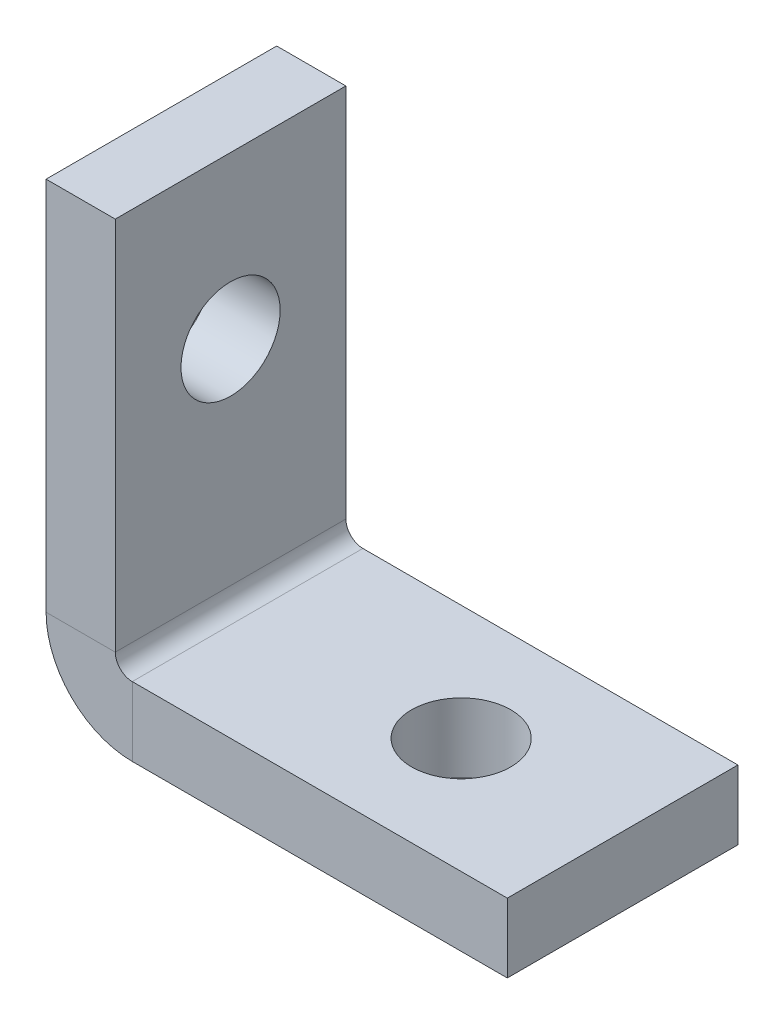
ISO-10303-21;
HEADER;
FILE_DESCRIPTION(('STEP AP214'),'2;1');
FILE_NAME('part.step','',(''),(''),'','','');
FILE_SCHEMA(('AUTOMOTIVE_DESIGN { 1 0 10303 214 1 1 1 1 }'));
ENDSEC;
DATA;
#1=APPLICATION_CONTEXT('core data for automotive mechanical design processes');
#2=APPLICATION_PROTOCOL_DEFINITION('international standard','automotive_design',2000,#1);
#3=PRODUCT_CONTEXT('',#1,'mechanical');
#4=PRODUCT('Part','Part','',(#3));
#5=PRODUCT_RELATED_PRODUCT_CATEGORY('part','',(#4));
#6=PRODUCT_DEFINITION_FORMATION('','',#4);
#7=PRODUCT_DEFINITION_CONTEXT('part definition',#1,'design');
#8=PRODUCT_DEFINITION('design','',#6,#7);
#9=PRODUCT_DEFINITION_SHAPE('','',#8);
#10=(LENGTH_UNIT() NAMED_UNIT(*) SI_UNIT(.MILLI.,.METRE.));
#11=(NAMED_UNIT(*) PLANE_ANGLE_UNIT() SI_UNIT($,.RADIAN.));
#12=(NAMED_UNIT(*) SI_UNIT($,.STERADIAN.) SOLID_ANGLE_UNIT());
#13=UNCERTAINTY_MEASURE_WITH_UNIT(LENGTH_MEASURE(1.E-05),#10,'distance_accuracy_value','');
#14=(GEOMETRIC_REPRESENTATION_CONTEXT(3) GLOBAL_UNCERTAINTY_ASSIGNED_CONTEXT((#13)) GLOBAL_UNIT_ASSIGNED_CONTEXT((#10,
#11,#12)) REPRESENTATION_CONTEXT('',''));
#15=CARTESIAN_POINT('',(0.,0.,0.));
#16=DIRECTION('',(0.,0.,1.));
#17=DIRECTION('',(1.,0.,0.));
#18=AXIS2_PLACEMENT_3D('',#15,#16,#17);
#19=CARTESIAN_POINT('',(0.,3.7366,10.));
#20=DIRECTION('',(0.,0.,1.));
#21=DIRECTION('',(1.,0.,0.));
#22=AXIS2_PLACEMENT_3D('',#19,#20,#21);
#23=PLANE('',#22);
#24=DIRECTION('',(1.,0.,0.));
#25=VECTOR('',#24,1.);
#26=CARTESIAN_POINT('',(0.,3.7366,10.));
#27=LINE('',#26,#25);
#28=CARTESIAN_POINT('',(0.,3.7366,10.));
#29=VERTEX_POINT('',#28);
#30=CARTESIAN_POINT('',(3.,3.7366,10.));
#31=VERTEX_POINT('',#30);
#32=EDGE_CURVE('E11',#29,#31,#27,.T.);
#33=ORIENTED_EDGE('',*,*,#32,.F.);
#34=CARTESIAN_POINT('',(3.7366,3.7366,10.));
#35=DIRECTION('',(0.,0.,-1.));
#36=DIRECTION('',(-1.,0.,0.));
#37=AXIS2_PLACEMENT_3D('',#34,#35,#36);
#38=CIRCLE('',#37,3.7366);
#39=CARTESIAN_POINT('',(3.7366,0.,10.));
#40=VERTEX_POINT('',#39);
#41=EDGE_CURVE('E135',#29,#40,#38,.F.);
#42=ORIENTED_EDGE('',*,*,#41,.T.);
#43=DIRECTION('',(0.,-1.,0.));
#44=VECTOR('',#43,1.);
#45=CARTESIAN_POINT('',(3.7366,3.,10.));
#46=LINE('',#45,#44);
#47=CARTESIAN_POINT('',(3.7366,3.,10.));
#48=VERTEX_POINT('',#47);
#49=EDGE_CURVE('E53',#48,#40,#46,.T.);
#50=ORIENTED_EDGE('',*,*,#49,.F.);
#51=CARTESIAN_POINT('',(3.7366,3.7366,10.));
#52=DIRECTION('',(0.,0.,1.));
#53=DIRECTION('',(1.,0.,0.));
#54=AXIS2_PLACEMENT_3D('',#51,#52,#53);
#55=CIRCLE('',#54,0.7366);
#56=EDGE_CURVE('E142',#31,#48,#55,.T.);
#57=ORIENTED_EDGE('',*,*,#56,.F.);
#58=EDGE_LOOP('',(#33,#42,#50,#57));
#59=FACE_BOUND('',#58,.T.);
#60=ADVANCED_FACE('F45',(#59),#23,.T.);
#61=CARTESIAN_POINT('',(3.7366,3.,10.));
#62=DIRECTION('',(0.,0.,1.));
#63=DIRECTION('',(1.,0.,0.));
#64=AXIS2_PLACEMENT_3D('',#61,#62,#63);
#65=PLANE('',#64);
#66=DIRECTION('',(0.,-1.,0.));
#67=VECTOR('',#66,1.);
#68=CARTESIAN_POINT('',(0.,20.,10.));
#69=LINE('',#68,#67);
#70=CARTESIAN_POINT('',(0.,20.,10.));
#71=VERTEX_POINT('',#70);
#72=EDGE_CURVE('E130',#71,#29,#69,.T.);
#73=ORIENTED_EDGE('',*,*,#72,.T.);
#74=ORIENTED_EDGE('',*,*,#32,.T.);
#75=DIRECTION('',(0.,1.,0.));
#76=VECTOR('',#75,1.);
#77=CARTESIAN_POINT('',(3.,20.,10.));
#78=LINE('',#77,#76);
#79=CARTESIAN_POINT('',(3.,20.,10.));
#80=VERTEX_POINT('',#79);
#81=EDGE_CURVE('E140',#80,#31,#78,.F.);
#82=ORIENTED_EDGE('',*,*,#81,.F.);
#83=DIRECTION('',(1.,0.,0.));
#84=VECTOR('',#83,1.);
#85=CARTESIAN_POINT('',(0.,20.,10.));
#86=LINE('',#85,#84);
#87=EDGE_CURVE('E121',#71,#80,#86,.T.);
#88=ORIENTED_EDGE('',*,*,#87,.F.);
#89=EDGE_LOOP('',(#73,#74,#82,#88));
#90=FACE_BOUND('',#89,.T.);
#91=ADVANCED_FACE('F138',(#90),#65,.T.);
#92=CARTESIAN_POINT('',(3.7366,0.,0.));
#93=DIRECTION('',(0.,0.,-1.));
#94=DIRECTION('',(-1.,0.,0.));
#95=AXIS2_PLACEMENT_3D('',#92,#93,#94);
#96=PLANE('',#95);
#97=DIRECTION('',(0.,1.,0.));
#98=VECTOR('',#97,1.);
#99=CARTESIAN_POINT('',(3.7366,0.,0.));
#100=LINE('',#99,#98);
#101=CARTESIAN_POINT('',(3.7366,0.,0.));
#102=VERTEX_POINT('',#101);
#103=CARTESIAN_POINT('',(3.7366,3.,0.));
#104=VERTEX_POINT('',#103);
#105=EDGE_CURVE('E96',#102,#104,#100,.T.);
#106=ORIENTED_EDGE('',*,*,#105,.F.);
#107=CARTESIAN_POINT('',(3.7366,3.7366,0.));
#108=DIRECTION('',(0.,0.,-1.));
#109=DIRECTION('',(-1.,0.,0.));
#110=AXIS2_PLACEMENT_3D('',#107,#108,#109);
#111=CIRCLE('',#110,3.7366);
#112=CARTESIAN_POINT('',(0.,3.7366,0.));
#113=VERTEX_POINT('',#112);
#114=EDGE_CURVE('E165',#113,#102,#111,.F.);
#115=ORIENTED_EDGE('',*,*,#114,.F.);
#116=DIRECTION('',(-1.,0.,0.));
#117=VECTOR('',#116,1.);
#118=CARTESIAN_POINT('',(3.,3.7366,0.));
#119=LINE('',#118,#117);
#120=CARTESIAN_POINT('',(3.,3.7366,0.));
#121=VERTEX_POINT('',#120);
#122=EDGE_CURVE('E89',#121,#113,#119,.T.);
#123=ORIENTED_EDGE('',*,*,#122,.F.);
#124=CARTESIAN_POINT('',(3.7366,3.7366,0.));
#125=DIRECTION('',(0.,0.,1.));
#126=DIRECTION('',(1.,0.,0.));
#127=AXIS2_PLACEMENT_3D('',#124,#125,#126);
#128=CIRCLE('',#127,0.7366);
#129=EDGE_CURVE('E158',#121,#104,#128,.T.);
#130=ORIENTED_EDGE('',*,*,#129,.T.);
#131=EDGE_LOOP('',(#106,#115,#123,#130));
#132=FACE_BOUND('',#131,.T.);
#133=ADVANCED_FACE('F197',(#132),#96,.T.);
#134=CARTESIAN_POINT('',(3.,3.7366,0.));
#135=DIRECTION('',(0.,0.,-1.));
#136=DIRECTION('',(-1.,0.,0.));
#137=AXIS2_PLACEMENT_3D('',#134,#135,#136);
#138=PLANE('',#137);
#139=DIRECTION('',(1.,0.,0.));
#140=VECTOR('',#139,1.);
#141=CARTESIAN_POINT('',(0.,0.,0.));
#142=LINE('',#141,#140);
#143=CARTESIAN_POINT('',(20.,0.,0.));
#144=VERTEX_POINT('',#143);
#145=EDGE_CURVE('E148',#102,#144,#142,.T.);
#146=ORIENTED_EDGE('',*,*,#145,.F.);
#147=ORIENTED_EDGE('',*,*,#105,.T.);
#148=DIRECTION('',(1.,0.,0.));
#149=VECTOR('',#148,1.);
#150=CARTESIAN_POINT('',(0.,3.,0.));
#151=LINE('',#150,#149);
#152=CARTESIAN_POINT('',(20.,3.,0.));
#153=VERTEX_POINT('',#152);
#154=EDGE_CURVE('E155',#104,#153,#151,.T.);
#155=ORIENTED_EDGE('',*,*,#154,.T.);
#156=DIRECTION('',(0.,-1.,0.));
#157=VECTOR('',#156,1.);
#158=CARTESIAN_POINT('',(20.,3.,0.));
#159=LINE('',#158,#157);
#160=EDGE_CURVE('E151',#153,#144,#159,.T.);
#161=ORIENTED_EDGE('',*,*,#160,.T.);
#162=EDGE_LOOP('',(#146,#147,#155,#161));
#163=FACE_BOUND('',#162,.T.);
#164=ADVANCED_FACE('F184',(#163),#138,.T.);
#165=CARTESIAN_POINT('',(0.,0.,10.));
#166=DIRECTION('',(0.,1.,0.));
#167=DIRECTION('',(0.,0.,1.));
#168=AXIS2_PLACEMENT_3D('',#165,#166,#167);
#169=PLANE('',#168);
#170=CARTESIAN_POINT('',(13.,0.,5.));
#171=DIRECTION('',(0.,-1.,0.));
#172=DIRECTION('',(0.,0.,-1.));
#173=AXIS2_PLACEMENT_3D('',#170,#171,#172);
#174=CIRCLE('',#173,2.14999999999999);
#175=CARTESIAN_POINT('',(13.,0.,2.85000000000001));
#176=VERTEX_POINT('',#175);
#177=EDGE_CURVE('E217',#176,#176,#174,.T.);
#178=ORIENTED_EDGE('',*,*,#177,.F.);
#179=EDGE_LOOP('',(#178));
#180=FACE_BOUND('',#179,.T.);
#181=ORIENTED_EDGE('',*,*,#145,.T.);
#182=DIRECTION('',(0.,0.,-1.));
#183=VECTOR('',#182,1.);
#184=CARTESIAN_POINT('',(20.,0.,10.));
#185=LINE('',#184,#183);
#186=CARTESIAN_POINT('',(20.,0.,10.));
#187=VERTEX_POINT('',#186);
#188=EDGE_CURVE('E179',#187,#144,#185,.T.);
#189=ORIENTED_EDGE('',*,*,#188,.F.);
#190=DIRECTION('',(1.,0.,0.));
#191=VECTOR('',#190,1.);
#192=CARTESIAN_POINT('',(0.,0.,10.));
#193=LINE('',#192,#191);
#194=EDGE_CURVE('E102',#40,#187,#193,.T.);
#195=ORIENTED_EDGE('',*,*,#194,.F.);
#196=DIRECTION('',(0.,0.,-1.));
#197=VECTOR('',#196,1.);
#198=CARTESIAN_POINT('',(3.7366,0.,10.));
#199=LINE('',#198,#197);
#200=EDGE_CURVE('E147',#40,#102,#199,.T.);
#201=ORIENTED_EDGE('',*,*,#200,.T.);
#202=EDGE_LOOP('',(#181,#189,#195,#201));
#203=FACE_BOUND('',#202,.T.);
#204=ADVANCED_FACE('F224',(#180,#203),#169,.F.);
#205=CARTESIAN_POINT('',(20.,3.,10.));
#206=DIRECTION('',(1.,0.,0.));
#207=DIRECTION('',(0.,0.,-1.));
#208=AXIS2_PLACEMENT_3D('',#205,#206,#207);
#209=PLANE('',#208);
#210=ORIENTED_EDGE('',*,*,#160,.F.);
#211=DIRECTION('',(0.,0.,-1.));
#212=VECTOR('',#211,1.);
#213=CARTESIAN_POINT('',(20.,3.,10.));
#214=LINE('',#213,#212);
#215=CARTESIAN_POINT('',(20.,3.,10.));
#216=VERTEX_POINT('',#215);
#217=EDGE_CURVE('E177',#216,#153,#214,.T.);
#218=ORIENTED_EDGE('',*,*,#217,.F.);
#219=DIRECTION('',(0.,-1.,0.));
#220=VECTOR('',#219,1.);
#221=CARTESIAN_POINT('',(20.,3.,10.));
#222=LINE('',#221,#220);
#223=EDGE_CURVE('E203',#216,#187,#222,.T.);
#224=ORIENTED_EDGE('',*,*,#223,.T.);
#225=ORIENTED_EDGE('',*,*,#188,.T.);
#226=EDGE_LOOP('',(#210,#218,#224,#225));
#227=FACE_BOUND('',#226,.T.);
#228=ADVANCED_FACE('F227',(#227),#209,.T.);
#229=CARTESIAN_POINT('',(0.,3.,10.));
#230=DIRECTION('',(0.,1.,0.));
#231=DIRECTION('',(0.,0.,1.));
#232=AXIS2_PLACEMENT_3D('',#229,#230,#231);
#233=PLANE('',#232);
#234=CARTESIAN_POINT('',(13.,3.,5.));
#235=DIRECTION('',(0.,1.,0.));
#236=DIRECTION('',(0.,0.,1.));
#237=AXIS2_PLACEMENT_3D('',#234,#235,#236);
#238=CIRCLE('',#237,2.14999999999999);
#239=CARTESIAN_POINT('',(13.,3.,7.15));
#240=VERTEX_POINT('',#239);
#241=EDGE_CURVE('E214',#240,#240,#238,.T.);
#242=ORIENTED_EDGE('',*,*,#241,.F.);
#243=EDGE_LOOP('',(#242));
#244=FACE_BOUND('',#243,.T.);
#245=ORIENTED_EDGE('',*,*,#154,.F.);
#246=DIRECTION('',(0.,0.,-1.));
#247=VECTOR('',#246,1.);
#248=CARTESIAN_POINT('',(3.7366,3.,10.));
#249=LINE('',#248,#247);
#250=EDGE_CURVE('E174',#48,#104,#249,.T.);
#251=ORIENTED_EDGE('',*,*,#250,.F.);
#252=DIRECTION('',(1.,0.,0.));
#253=VECTOR('',#252,1.);
#254=CARTESIAN_POINT('',(0.,3.,10.));
#255=LINE('',#254,#253);
#256=EDGE_CURVE('E202',#48,#216,#255,.T.);
#257=ORIENTED_EDGE('',*,*,#256,.T.);
#258=ORIENTED_EDGE('',*,*,#217,.T.);
#259=EDGE_LOOP('',(#245,#251,#257,#258));
#260=FACE_BOUND('',#259,.T.);
#261=ADVANCED_FACE('F195',(#244,#260),#233,.T.);
#262=CARTESIAN_POINT('',(3.7366,3.7366,10.));
#263=DIRECTION('',(0.,0.,-1.));
#264=DIRECTION('',(-1.,0.,0.));
#265=AXIS2_PLACEMENT_3D('',#262,#263,#264);
#266=CYLINDRICAL_SURFACE('',#265,0.7366);
#267=ORIENTED_EDGE('',*,*,#129,.F.);
#268=DIRECTION('',(0.,0.,-1.));
#269=VECTOR('',#268,1.);
#270=CARTESIAN_POINT('',(3.,3.7366,10.));
#271=LINE('',#270,#269);
#272=EDGE_CURVE('E171',#31,#121,#271,.T.);
#273=ORIENTED_EDGE('',*,*,#272,.F.);
#274=ORIENTED_EDGE('',*,*,#56,.T.);
#275=ORIENTED_EDGE('',*,*,#250,.T.);
#276=EDGE_LOOP('',(#267,#273,#274,#275));
#277=FACE_BOUND('',#276,.T.);
#278=ADVANCED_FACE('F190',(#277),#266,.F.);
#279=CARTESIAN_POINT('',(3.,20.,10.));
#280=DIRECTION('',(1.,0.,0.));
#281=DIRECTION('',(0.,0.,-1.));
#282=AXIS2_PLACEMENT_3D('',#279,#280,#281);
#283=PLANE('',#282);
#284=CARTESIAN_POINT('',(3.,13.,5.));
#285=DIRECTION('',(1.,0.,0.));
#286=DIRECTION('',(0.,0.,-1.));
#287=AXIS2_PLACEMENT_3D('',#284,#285,#286);
#288=CIRCLE('',#287,2.14999999999999);
#289=CARTESIAN_POINT('',(3.,13.,2.85000000000001));
#290=VERTEX_POINT('',#289);
#291=EDGE_CURVE('E152',#290,#290,#288,.T.);
#292=ORIENTED_EDGE('',*,*,#291,.F.);
#293=EDGE_LOOP('',(#292));
#294=FACE_BOUND('',#293,.T.);
#295=DIRECTION('',(0.,1.,0.));
#296=VECTOR('',#295,1.);
#297=CARTESIAN_POINT('',(3.,20.,0.));
#298=LINE('',#297,#296);
#299=CARTESIAN_POINT('',(3.,20.,0.));
#300=VERTEX_POINT('',#299);
#301=EDGE_CURVE('E160',#300,#121,#298,.F.);
#302=ORIENTED_EDGE('',*,*,#301,.F.);
#303=DIRECTION('',(0.,0.,-1.));
#304=VECTOR('',#303,1.);
#305=CARTESIAN_POINT('',(3.,20.,10.));
#306=LINE('',#305,#304);
#307=EDGE_CURVE('E125',#80,#300,#306,.T.);
#308=ORIENTED_EDGE('',*,*,#307,.F.);
#309=ORIENTED_EDGE('',*,*,#81,.T.);
#310=ORIENTED_EDGE('',*,*,#272,.T.);
#311=EDGE_LOOP('',(#302,#308,#309,#310));
#312=FACE_BOUND('',#311,.T.);
#313=ADVANCED_FACE('F200',(#294,#312),#283,.T.);
#314=CARTESIAN_POINT('',(0.,20.,10.));
#315=DIRECTION('',(0.,1.,0.));
#316=DIRECTION('',(0.,0.,1.));
#317=AXIS2_PLACEMENT_3D('',#314,#315,#316);
#318=PLANE('',#317);
#319=DIRECTION('',(1.,0.,0.));
#320=VECTOR('',#319,1.);
#321=CARTESIAN_POINT('',(0.,20.,0.));
#322=LINE('',#321,#320);
#323=CARTESIAN_POINT('',(0.,20.,0.));
#324=VERTEX_POINT('',#323);
#325=EDGE_CURVE('E123',#324,#300,#322,.T.);
#326=ORIENTED_EDGE('',*,*,#325,.F.);
#327=DIRECTION('',(0.,0.,-1.));
#328=VECTOR('',#327,1.);
#329=CARTESIAN_POINT('',(0.,20.,10.));
#330=LINE('',#329,#328);
#331=EDGE_CURVE('E117',#71,#324,#330,.T.);
#332=ORIENTED_EDGE('',*,*,#331,.F.);
#333=ORIENTED_EDGE('',*,*,#87,.T.);
#334=ORIENTED_EDGE('',*,*,#307,.T.);
#335=EDGE_LOOP('',(#326,#332,#333,#334));
#336=FACE_BOUND('',#335,.T.);
#337=ADVANCED_FACE('F119',(#336),#318,.T.);
#338=CARTESIAN_POINT('',(0.,20.,10.));
#339=DIRECTION('',(1.,0.,0.));
#340=DIRECTION('',(0.,0.,-1.));
#341=AXIS2_PLACEMENT_3D('',#338,#339,#340);
#342=PLANE('',#341);
#343=CARTESIAN_POINT('',(0.,13.,5.));
#344=DIRECTION('',(-1.,0.,0.));
#345=DIRECTION('',(0.,0.,1.));
#346=AXIS2_PLACEMENT_3D('',#343,#344,#345);
#347=CIRCLE('',#346,2.14999999999999);
#348=CARTESIAN_POINT('',(0.,13.,7.14999999999999));
#349=VERTEX_POINT('',#348);
#350=EDGE_CURVE('E211',#349,#349,#347,.T.);
#351=ORIENTED_EDGE('',*,*,#350,.F.);
#352=EDGE_LOOP('',(#351));
#353=FACE_BOUND('',#352,.T.);
#354=DIRECTION('',(0.,-1.,0.));
#355=VECTOR('',#354,1.);
#356=CARTESIAN_POINT('',(0.,20.,0.));
#357=LINE('',#356,#355);
#358=EDGE_CURVE('E163',#324,#113,#357,.T.);
#359=ORIENTED_EDGE('',*,*,#358,.T.);
#360=DIRECTION('',(0.,0.,-1.));
#361=VECTOR('',#360,1.);
#362=CARTESIAN_POINT('',(0.,3.7366,10.));
#363=LINE('',#362,#361);
#364=EDGE_CURVE('E126',#29,#113,#363,.T.);
#365=ORIENTED_EDGE('',*,*,#364,.F.);
#366=ORIENTED_EDGE('',*,*,#72,.F.);
#367=ORIENTED_EDGE('',*,*,#331,.T.);
#368=EDGE_LOOP('',(#359,#365,#366,#367));
#369=FACE_BOUND('',#368,.T.);
#370=ADVANCED_FACE('F131',(#353,#369),#342,.F.);
#371=CARTESIAN_POINT('',(3.7366,3.7366,10.));
#372=DIRECTION('',(0.,0.,-1.));
#373=DIRECTION('',(-1.,0.,0.));
#374=AXIS2_PLACEMENT_3D('',#371,#372,#373);
#375=CYLINDRICAL_SURFACE('',#374,3.7366);
#376=ORIENTED_EDGE('',*,*,#114,.T.);
#377=ORIENTED_EDGE('',*,*,#200,.F.);
#378=ORIENTED_EDGE('',*,*,#41,.F.);
#379=ORIENTED_EDGE('',*,*,#364,.T.);
#380=EDGE_LOOP('',(#376,#377,#378,#379));
#381=FACE_BOUND('',#380,.T.);
#382=ADVANCED_FACE('F234',(#381),#375,.T.);
#383=CARTESIAN_POINT('',(3.7366,3.7366,10.));
#384=DIRECTION('',(0.,0.,1.));
#385=DIRECTION('',(1.,0.,0.));
#386=AXIS2_PLACEMENT_3D('',#383,#384,#385);
#387=PLANE('',#386);
#388=ORIENTED_EDGE('',*,*,#194,.T.);
#389=ORIENTED_EDGE('',*,*,#223,.F.);
#390=ORIENTED_EDGE('',*,*,#256,.F.);
#391=ORIENTED_EDGE('',*,*,#49,.T.);
#392=EDGE_LOOP('',(#388,#389,#390,#391));
#393=FACE_BOUND('',#392,.T.);
#394=ADVANCED_FACE('F231',(#393),#387,.T.);
#395=CARTESIAN_POINT('',(3.7366,3.7366,0.));
#396=DIRECTION('',(0.,0.,1.));
#397=DIRECTION('',(1.,0.,0.));
#398=AXIS2_PLACEMENT_3D('',#395,#396,#397);
#399=PLANE('',#398);
#400=ORIENTED_EDGE('',*,*,#301,.T.);
#401=ORIENTED_EDGE('',*,*,#122,.T.);
#402=ORIENTED_EDGE('',*,*,#358,.F.);
#403=ORIENTED_EDGE('',*,*,#325,.T.);
#404=EDGE_LOOP('',(#400,#401,#402,#403));
#405=FACE_BOUND('',#404,.T.);
#406=ADVANCED_FACE('F233',(#405),#399,.F.);
#407=CARTESIAN_POINT('',(0.,13.,5.));
#408=DIRECTION('',(-1.,0.,0.));
#409=DIRECTION('',(0.,0.,1.));
#410=AXIS2_PLACEMENT_3D('',#407,#408,#409);
#411=CYLINDRICAL_SURFACE('',#410,2.14999999999999);
#412=ORIENTED_EDGE('',*,*,#350,.T.);
#413=EDGE_LOOP('',(#412));
#414=FACE_BOUND('',#413,.T.);
#415=ORIENTED_EDGE('',*,*,#291,.T.);
#416=EDGE_LOOP('',(#415));
#417=FACE_BOUND('',#416,.T.);
#418=ADVANCED_FACE('F240',(#414,#417),#411,.F.);
#419=CARTESIAN_POINT('',(13.,0.,5.));
#420=DIRECTION('',(0.,-1.,0.));
#421=DIRECTION('',(0.,0.,-1.));
#422=AXIS2_PLACEMENT_3D('',#419,#420,#421);
#423=CYLINDRICAL_SURFACE('',#422,2.14999999999999);
#424=ORIENTED_EDGE('',*,*,#177,.T.);
#425=EDGE_LOOP('',(#424));
#426=FACE_BOUND('',#425,.T.);
#427=ORIENTED_EDGE('',*,*,#241,.T.);
#428=EDGE_LOOP('',(#427));
#429=FACE_BOUND('',#428,.T.);
#430=ADVANCED_FACE('F221',(#426,#429),#423,.F.);
#431=CLOSED_SHELL('',(#60,#91,#133,#164,#204,#228,#261,#278,#313,#337,#370,#382,#394,#406,#418,#430));
#432=MANIFOLD_SOLID_BREP('B2',#431);
#433=ADVANCED_BREP_SHAPE_REPRESENTATION('',(#18,#432),#14);
#434=SHAPE_DEFINITION_REPRESENTATION(#9,#433);
ENDSEC;
END-ISO-10303-21;
